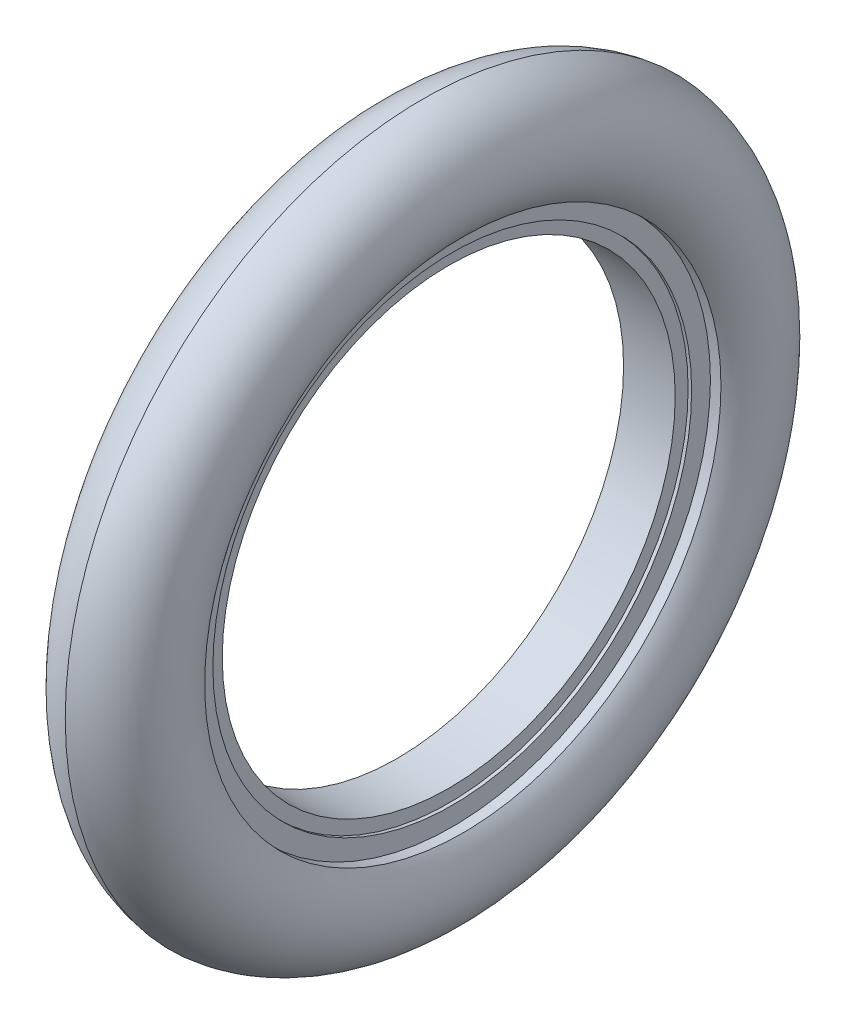
ISO-10303-21;
HEADER;
FILE_DESCRIPTION(('STEP AP214'),'2;1');
FILE_NAME('part.step','',(''),(''),'','','');
FILE_SCHEMA(('AUTOMOTIVE_DESIGN { 1 0 10303 214 1 1 1 1 }'));
ENDSEC;
DATA;
#1=APPLICATION_CONTEXT('core data for automotive mechanical design processes');
#2=APPLICATION_PROTOCOL_DEFINITION('international standard','automotive_design',2000,#1);
#3=PRODUCT_CONTEXT('',#1,'mechanical');
#4=PRODUCT('Part','Part','',(#3));
#5=PRODUCT_RELATED_PRODUCT_CATEGORY('part','',(#4));
#6=PRODUCT_DEFINITION_FORMATION('','',#4);
#7=PRODUCT_DEFINITION_CONTEXT('part definition',#1,'design');
#8=PRODUCT_DEFINITION('design','',#6,#7);
#9=PRODUCT_DEFINITION_SHAPE('','',#8);
#10=(LENGTH_UNIT() NAMED_UNIT(*) SI_UNIT(.MILLI.,.METRE.));
#11=(NAMED_UNIT(*) PLANE_ANGLE_UNIT() SI_UNIT($,.RADIAN.));
#12=(NAMED_UNIT(*) SI_UNIT($,.STERADIAN.) SOLID_ANGLE_UNIT());
#13=UNCERTAINTY_MEASURE_WITH_UNIT(LENGTH_MEASURE(1.E-05),#10,'distance_accuracy_value','');
#14=(GEOMETRIC_REPRESENTATION_CONTEXT(3) GLOBAL_UNCERTAINTY_ASSIGNED_CONTEXT((#13)) GLOBAL_UNIT_ASSIGNED_CONTEXT((#10,
#11,#12)) REPRESENTATION_CONTEXT('',''));
#15=CARTESIAN_POINT('',(0.,0.,0.));
#16=DIRECTION('',(0.,0.,1.));
#17=DIRECTION('',(1.,0.,0.));
#18=AXIS2_PLACEMENT_3D('',#15,#16,#17);
#19=CARTESIAN_POINT('',(-11.,0.,0.));
#20=DIRECTION('',(1.,0.,0.));
#21=DIRECTION('',(0.,0.,-1.));
#22=AXIS2_PLACEMENT_3D('',#19,#20,#21);
#23=CYLINDRICAL_SURFACE('',#22,96.5000000000001);
#24=CARTESIAN_POINT('',(-11.,0.,0.));
#25=DIRECTION('',(1.,0.,0.));
#26=DIRECTION('',(0.,0.,-1.));
#27=AXIS2_PLACEMENT_3D('',#24,#25,#26);
#28=CIRCLE('',#27,96.5000000000001);
#29=CARTESIAN_POINT('',(-11.,0.,-96.5000000000001));
#30=VERTEX_POINT('',#29);
#31=EDGE_CURVE('E19',#30,#30,#28,.T.);
#32=ORIENTED_EDGE('',*,*,#31,.F.);
#33=EDGE_LOOP('',(#32));
#34=FACE_BOUND('',#33,.T.);
#35=CARTESIAN_POINT('',(11.,0.,0.));
#36=DIRECTION('',(1.,0.,0.));
#37=DIRECTION('',(0.,0.,-1.));
#38=AXIS2_PLACEMENT_3D('',#35,#36,#37);
#39=CIRCLE('',#38,96.5000000000001);
#40=CARTESIAN_POINT('',(11.,0.,-96.5000000000001));
#41=VERTEX_POINT('',#40);
#42=EDGE_CURVE('E54',#41,#41,#39,.F.);
#43=ORIENTED_EDGE('',*,*,#42,.F.);
#44=EDGE_LOOP('',(#43));
#45=FACE_BOUND('',#44,.T.);
#46=ADVANCED_FACE('F14',(#34,#45),#23,.F.);
#47=CARTESIAN_POINT('',(-11.,-112.2,-112.2));
#48=DIRECTION('',(-1.,0.,0.));
#49=DIRECTION('',(0.,0.,1.));
#50=AXIS2_PLACEMENT_3D('',#47,#48,#49);
#51=PLANE('',#50);
#52=ORIENTED_EDGE('',*,*,#31,.T.);
#53=EDGE_LOOP('',(#52));
#54=FACE_BOUND('',#53,.T.);
#55=CARTESIAN_POINT('',(-11.,0.,0.));
#56=DIRECTION('',(1.,0.,0.));
#57=DIRECTION('',(0.,0.,-1.));
#58=AXIS2_PLACEMENT_3D('',#55,#56,#57);
#59=CIRCLE('',#58,102.);
#60=CARTESIAN_POINT('',(-11.,0.,-102.));
#61=VERTEX_POINT('',#60);
#62=EDGE_CURVE('E52',#61,#61,#59,.T.);
#63=ORIENTED_EDGE('',*,*,#62,.F.);
#64=EDGE_LOOP('',(#63));
#65=FACE_BOUND('',#64,.T.);
#66=ADVANCED_FACE('F61',(#54,#65),#51,.T.);
#67=CARTESIAN_POINT('',(11.,-112.2,112.2));
#68=DIRECTION('',(1.,0.,0.));
#69=DIRECTION('',(0.,0.,-1.));
#70=AXIS2_PLACEMENT_3D('',#67,#68,#69);
#71=PLANE('',#70);
#72=ORIENTED_EDGE('',*,*,#42,.T.);
#73=EDGE_LOOP('',(#72));
#74=FACE_BOUND('',#73,.T.);
#75=CARTESIAN_POINT('',(11.,0.,0.));
#76=DIRECTION('',(1.,0.,0.));
#77=DIRECTION('',(0.,0.,-1.));
#78=AXIS2_PLACEMENT_3D('',#75,#76,#77);
#79=CIRCLE('',#78,102.);
#80=CARTESIAN_POINT('',(11.,0.,-102.));
#81=VERTEX_POINT('',#80);
#82=EDGE_CURVE('E49',#81,#81,#79,.F.);
#83=ORIENTED_EDGE('',*,*,#82,.F.);
#84=EDGE_LOOP('',(#83));
#85=FACE_BOUND('',#84,.T.);
#86=ADVANCED_FACE('F71',(#74,#85),#71,.T.);
#87=CARTESIAN_POINT('',(-12.5,0.,0.));
#88=DIRECTION('',(1.,0.,0.));
#89=DIRECTION('',(0.,0.,-1.));
#90=AXIS2_PLACEMENT_3D('',#87,#88,#89);
#91=CYLINDRICAL_SURFACE('',#90,102.);
#92=ORIENTED_EDGE('',*,*,#62,.T.);
#93=EDGE_LOOP('',(#92));
#94=FACE_BOUND('',#93,.T.);
#95=CARTESIAN_POINT('',(-12.5,0.,0.));
#96=DIRECTION('',(1.,0.,0.));
#97=DIRECTION('',(0.,0.,-1.));
#98=AXIS2_PLACEMENT_3D('',#95,#96,#97);
#99=CIRCLE('',#98,102.);
#100=CARTESIAN_POINT('',(-12.5,0.,-102.));
#101=VERTEX_POINT('',#100);
#102=EDGE_CURVE('E46',#101,#101,#99,.T.);
#103=ORIENTED_EDGE('',*,*,#102,.F.);
#104=EDGE_LOOP('',(#103));
#105=FACE_BOUND('',#104,.T.);
#106=ADVANCED_FACE('F114',(#94,#105),#91,.F.);
#107=CARTESIAN_POINT('',(11.,0.,0.));
#108=DIRECTION('',(1.,0.,0.));
#109=DIRECTION('',(0.,0.,-1.));
#110=AXIS2_PLACEMENT_3D('',#107,#108,#109);
#111=CYLINDRICAL_SURFACE('',#110,102.);
#112=CARTESIAN_POINT('',(12.5,0.,0.));
#113=DIRECTION('',(1.,0.,0.));
#114=DIRECTION('',(0.,0.,-1.));
#115=AXIS2_PLACEMENT_3D('',#112,#113,#114);
#116=CIRCLE('',#115,102.);
#117=CARTESIAN_POINT('',(12.5,0.,-102.));
#118=VERTEX_POINT('',#117);
#119=EDGE_CURVE('E43',#118,#118,#116,.F.);
#120=ORIENTED_EDGE('',*,*,#119,.F.);
#121=EDGE_LOOP('',(#120));
#122=FACE_BOUND('',#121,.T.);
#123=ORIENTED_EDGE('',*,*,#82,.T.);
#124=EDGE_LOOP('',(#123));
#125=FACE_BOUND('',#124,.T.);
#126=ADVANCED_FACE('F100',(#122,#125),#111,.F.);
#127=CARTESIAN_POINT('',(-12.5,-121.,-121.));
#128=DIRECTION('',(-1.,0.,0.));
#129=DIRECTION('',(0.,0.,1.));
#130=AXIS2_PLACEMENT_3D('',#127,#128,#129);
#131=PLANE('',#130);
#132=ORIENTED_EDGE('',*,*,#102,.T.);
#133=EDGE_LOOP('',(#132));
#134=FACE_BOUND('',#133,.T.);
#135=CARTESIAN_POINT('',(-12.5,0.,0.));
#136=DIRECTION('',(1.,0.,0.));
#137=DIRECTION('',(0.,0.,-1.));
#138=AXIS2_PLACEMENT_3D('',#135,#136,#137);
#139=CIRCLE('',#138,110.);
#140=CARTESIAN_POINT('',(-12.5,0.,-110.));
#141=VERTEX_POINT('',#140);
#142=EDGE_CURVE('E40',#141,#141,#139,.T.);
#143=ORIENTED_EDGE('',*,*,#142,.F.);
#144=EDGE_LOOP('',(#143));
#145=FACE_BOUND('',#144,.T.);
#146=ADVANCED_FACE('F91',(#134,#145),#131,.T.);
#147=CARTESIAN_POINT('',(12.5,-121.,121.));
#148=DIRECTION('',(1.,0.,0.));
#149=DIRECTION('',(0.,0.,-1.));
#150=AXIS2_PLACEMENT_3D('',#147,#148,#149);
#151=PLANE('',#150);
#152=ORIENTED_EDGE('',*,*,#119,.T.);
#153=EDGE_LOOP('',(#152));
#154=FACE_BOUND('',#153,.T.);
#155=CARTESIAN_POINT('',(12.5,0.,0.));
#156=DIRECTION('',(1.,0.,0.));
#157=DIRECTION('',(0.,0.,-1.));
#158=AXIS2_PLACEMENT_3D('',#155,#156,#157);
#159=CIRCLE('',#158,110.);
#160=CARTESIAN_POINT('',(12.5,0.,-110.));
#161=VERTEX_POINT('',#160);
#162=EDGE_CURVE('E37',#161,#161,#159,.F.);
#163=ORIENTED_EDGE('',*,*,#162,.F.);
#164=EDGE_LOOP('',(#163));
#165=FACE_BOUND('',#164,.T.);
#166=ADVANCED_FACE('F89',(#154,#165),#151,.T.);
#167=CARTESIAN_POINT('',(-17.,0.,0.));
#168=DIRECTION('',(1.,0.,0.));
#169=DIRECTION('',(0.,0.,-1.));
#170=AXIS2_PLACEMENT_3D('',#167,#168,#169);
#171=CYLINDRICAL_SURFACE('',#170,110.);
#172=ORIENTED_EDGE('',*,*,#142,.T.);
#173=EDGE_LOOP('',(#172));
#174=FACE_BOUND('',#173,.T.);
#175=CARTESIAN_POINT('',(-17.0000000000001,0.,0.));
#176=DIRECTION('',(-1.,0.,0.));
#177=DIRECTION('',(0.,0.,-1.));
#178=AXIS2_PLACEMENT_3D('',#175,#176,#177);
#179=CIRCLE('',#178,110.);
#180=CARTESIAN_POINT('',(-17.0000000000001,0.,-110.));
#181=VERTEX_POINT('',#180);
#182=EDGE_CURVE('E28',#181,#181,#179,.F.);
#183=ORIENTED_EDGE('',*,*,#182,.F.);
#184=EDGE_LOOP('',(#183));
#185=FACE_BOUND('',#184,.T.);
#186=ADVANCED_FACE('F85',(#174,#185),#171,.F.);
#187=CARTESIAN_POINT('',(12.5,0.,0.));
#188=DIRECTION('',(1.,0.,0.));
#189=DIRECTION('',(0.,0.,-1.));
#190=AXIS2_PLACEMENT_3D('',#187,#188,#189);
#191=CYLINDRICAL_SURFACE('',#190,110.);
#192=CARTESIAN_POINT('',(17.0000000000001,0.,0.));
#193=DIRECTION('',(-1.,0.,0.));
#194=DIRECTION('',(0.,0.,-1.));
#195=AXIS2_PLACEMENT_3D('',#192,#193,#194);
#196=CIRCLE('',#195,110.);
#197=CARTESIAN_POINT('',(17.0000000000001,0.,-110.));
#198=VERTEX_POINT('',#197);
#199=EDGE_CURVE('E23',#198,#198,#196,.T.);
#200=ORIENTED_EDGE('',*,*,#199,.F.);
#201=EDGE_LOOP('',(#200));
#202=FACE_BOUND('',#201,.T.);
#203=ORIENTED_EDGE('',*,*,#162,.T.);
#204=EDGE_LOOP('',(#203));
#205=FACE_BOUND('',#204,.T.);
#206=ADVANCED_FACE('F78',(#202,#205),#191,.F.);
#207=CARTESIAN_POINT('',(2.60881108271449,0.,0.));
#208=DIRECTION('',(-1.,0.,0.));
#209=DIRECTION('',(0.,0.,-1.));
#210=AXIS2_PLACEMENT_3D('',#207,#208,#209);
#211=TOROIDAL_SURFACE('',#210,126.745995556459,25.7863110827146);
#212=ORIENTED_EDGE('',*,*,#182,.T.);
#213=EDGE_LOOP('',(#212));
#214=FACE_BOUND('',#213,.T.);
#215=CARTESIAN_POINT('',(0.,0.,0.));
#216=DIRECTION('',(-1.,0.,0.));
#217=DIRECTION('',(0.,0.,-1.));
#218=AXIS2_PLACEMENT_3D('',#215,#216,#217);
#219=CIRCLE('',#218,152.4);
#220=CARTESIAN_POINT('',(0.,0.,-152.4));
#221=VERTEX_POINT('',#220);
#222=EDGE_CURVE('E9',#221,#221,#219,.F.);
#223=ORIENTED_EDGE('',*,*,#222,.F.);
#224=EDGE_LOOP('',(#223));
#225=FACE_BOUND('',#224,.T.);
#226=ADVANCED_FACE('F74',(#214,#225),#211,.T.);
#227=CARTESIAN_POINT('',(-2.60881108271449,0.,0.));
#228=DIRECTION('',(-1.,0.,0.));
#229=DIRECTION('',(0.,0.,-1.));
#230=AXIS2_PLACEMENT_3D('',#227,#228,#229);
#231=TOROIDAL_SURFACE('',#230,126.745995556459,25.7863110827146);
#232=ORIENTED_EDGE('',*,*,#222,.T.);
#233=EDGE_LOOP('',(#232));
#234=FACE_BOUND('',#233,.T.);
#235=ORIENTED_EDGE('',*,*,#199,.T.);
#236=EDGE_LOOP('',(#235));
#237=FACE_BOUND('',#236,.T.);
#238=ADVANCED_FACE('F16',(#234,#237),#231,.T.);
#239=CLOSED_SHELL('',(#46,#66,#86,#106,#126,#146,#166,#186,#206,#226,#238));
#240=MANIFOLD_SOLID_BREP('B1',#239);
#241=ADVANCED_BREP_SHAPE_REPRESENTATION('',(#18,#240),#14);
#242=SHAPE_DEFINITION_REPRESENTATION(#9,#241);
ENDSEC;
END-ISO-10303-21;
